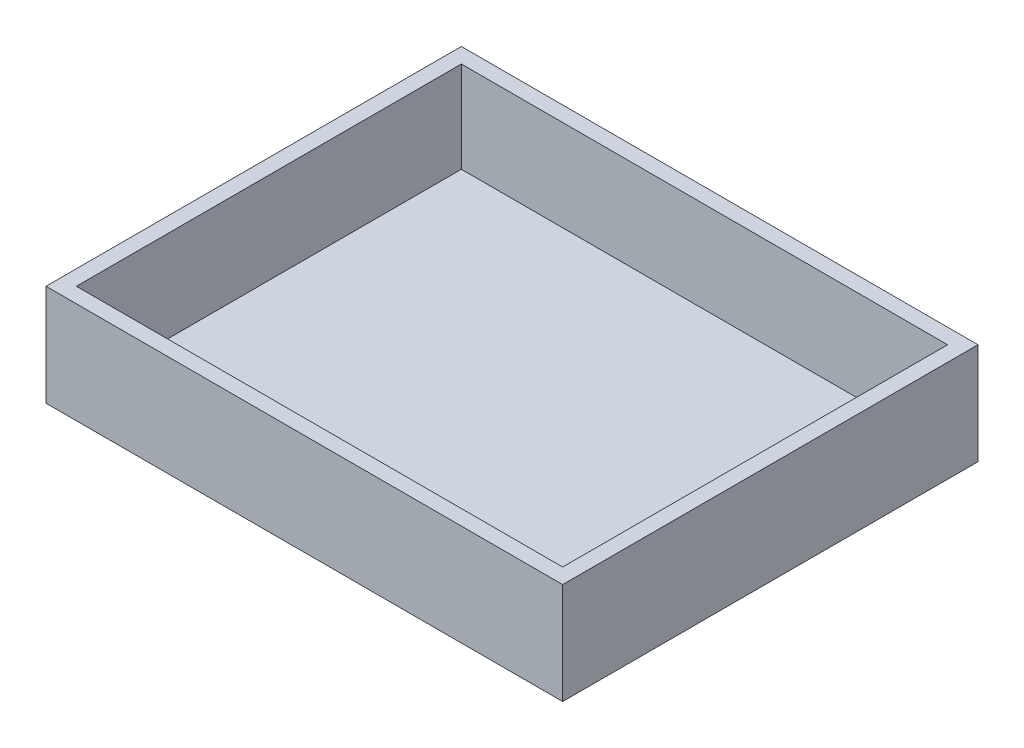
ISO-10303-21;
HEADER;
FILE_DESCRIPTION(('STEP AP214'),'2;1');
FILE_NAME('part.step','',(''),(''),'','','');
FILE_SCHEMA(('AUTOMOTIVE_DESIGN { 1 0 10303 214 1 1 1 1 }'));
ENDSEC;
DATA;
#1=APPLICATION_CONTEXT('core data for automotive mechanical design processes');
#2=APPLICATION_PROTOCOL_DEFINITION('international standard','automotive_design',2000,#1);
#3=PRODUCT_CONTEXT('',#1,'mechanical');
#4=PRODUCT('Part','Part','',(#3));
#5=PRODUCT_RELATED_PRODUCT_CATEGORY('part','',(#4));
#6=PRODUCT_DEFINITION_FORMATION('','',#4);
#7=PRODUCT_DEFINITION_CONTEXT('part definition',#1,'design');
#8=PRODUCT_DEFINITION('design','',#6,#7);
#9=PRODUCT_DEFINITION_SHAPE('','',#8);
#10=(LENGTH_UNIT() NAMED_UNIT(*) SI_UNIT(.MILLI.,.METRE.));
#11=(NAMED_UNIT(*) PLANE_ANGLE_UNIT() SI_UNIT($,.RADIAN.));
#12=(NAMED_UNIT(*) SI_UNIT($,.STERADIAN.) SOLID_ANGLE_UNIT());
#13=UNCERTAINTY_MEASURE_WITH_UNIT(LENGTH_MEASURE(1.E-05),#10,'distance_accuracy_value','');
#14=(GEOMETRIC_REPRESENTATION_CONTEXT(3) GLOBAL_UNCERTAINTY_ASSIGNED_CONTEXT((#13)) GLOBAL_UNIT_ASSIGNED_CONTEXT((#10,
#11,#12)) REPRESENTATION_CONTEXT('',''));
#15=CARTESIAN_POINT('',(0.,0.,0.));
#16=DIRECTION('',(0.,0.,1.));
#17=DIRECTION('',(1.,0.,0.));
#18=AXIS2_PLACEMENT_3D('',#15,#16,#17);
#19=CARTESIAN_POINT('',(0.,1.,-20.5));
#20=DIRECTION('',(0.,0.,-1.));
#21=DIRECTION('',(-1.,0.,0.));
#22=AXIS2_PLACEMENT_3D('',#19,#20,#21);
#23=PLANE('',#22);
#24=DIRECTION('',(1.,0.,0.));
#25=VECTOR('',#24,1.);
#26=CARTESIAN_POINT('',(0.,0.,-20.5));
#27=LINE('',#26,#25);
#28=CARTESIAN_POINT('',(-25.5,0.,-20.5));
#29=VERTEX_POINT('',#28);
#30=CARTESIAN_POINT('',(25.5,0.,-20.5));
#31=VERTEX_POINT('',#30);
#32=EDGE_CURVE('E149',#29,#31,#27,.T.);
#33=ORIENTED_EDGE('',*,*,#32,.F.);
#34=DIRECTION('',(0.,-1.,0.));
#35=VECTOR('',#34,1.);
#36=CARTESIAN_POINT('',(-25.5,1.,-20.5));
#37=LINE('',#36,#35);
#38=CARTESIAN_POINT('',(-25.5,10.,-20.5));
#39=VERTEX_POINT('',#38);
#40=EDGE_CURVE('E11',#39,#29,#37,.T.);
#41=ORIENTED_EDGE('',*,*,#40,.F.);
#42=DIRECTION('',(-1.,0.,0.));
#43=VECTOR('',#42,1.);
#44=CARTESIAN_POINT('',(-25.5,10.,-20.5));
#45=LINE('',#44,#43);
#46=CARTESIAN_POINT('',(25.5,10.,-20.5));
#47=VERTEX_POINT('',#46);
#48=EDGE_CURVE('E139',#47,#39,#45,.T.);
#49=ORIENTED_EDGE('',*,*,#48,.F.);
#50=DIRECTION('',(0.,-1.,0.));
#51=VECTOR('',#50,1.);
#52=CARTESIAN_POINT('',(25.5,1.,-20.5));
#53=LINE('',#52,#51);
#54=EDGE_CURVE('E160',#47,#31,#53,.T.);
#55=ORIENTED_EDGE('',*,*,#54,.T.);
#56=EDGE_LOOP('',(#33,#41,#49,#55));
#57=FACE_BOUND('',#56,.T.);
#58=ADVANCED_FACE('F37',(#57),#23,.T.);
#59=CARTESIAN_POINT('',(-25.5,1.,0.));
#60=DIRECTION('',(1.,0.,0.));
#61=DIRECTION('',(0.,0.,-1.));
#62=AXIS2_PLACEMENT_3D('',#59,#60,#61);
#63=PLANE('',#62);
#64=DIRECTION('',(0.,0.,1.));
#65=VECTOR('',#64,1.);
#66=CARTESIAN_POINT('',(-25.5,0.,0.));
#67=LINE('',#66,#65);
#68=CARTESIAN_POINT('',(-25.5,0.,20.5));
#69=VERTEX_POINT('',#68);
#70=EDGE_CURVE('E152',#29,#69,#67,.T.);
#71=ORIENTED_EDGE('',*,*,#70,.T.);
#72=DIRECTION('',(0.,-1.,0.));
#73=VECTOR('',#72,1.);
#74=CARTESIAN_POINT('',(-25.5,1.,20.5));
#75=LINE('',#74,#73);
#76=CARTESIAN_POINT('',(-25.5,10.,20.5));
#77=VERTEX_POINT('',#76);
#78=EDGE_CURVE('E44',#77,#69,#75,.T.);
#79=ORIENTED_EDGE('',*,*,#78,.F.);
#80=DIRECTION('',(0.,0.,1.));
#81=VECTOR('',#80,1.);
#82=CARTESIAN_POINT('',(-25.5,10.,-20.5));
#83=LINE('',#82,#81);
#84=EDGE_CURVE('E114',#39,#77,#83,.T.);
#85=ORIENTED_EDGE('',*,*,#84,.F.);
#86=ORIENTED_EDGE('',*,*,#40,.T.);
#87=EDGE_LOOP('',(#71,#79,#85,#86));
#88=FACE_BOUND('',#87,.T.);
#89=ADVANCED_FACE('F180',(#88),#63,.F.);
#90=CARTESIAN_POINT('',(0.,1.,20.5));
#91=DIRECTION('',(0.,0.,-1.));
#92=DIRECTION('',(-1.,0.,0.));
#93=AXIS2_PLACEMENT_3D('',#90,#91,#92);
#94=PLANE('',#93);
#95=DIRECTION('',(1.,0.,0.));
#96=VECTOR('',#95,1.);
#97=CARTESIAN_POINT('',(0.,0.,20.5));
#98=LINE('',#97,#96);
#99=CARTESIAN_POINT('',(25.5,0.,20.5));
#100=VERTEX_POINT('',#99);
#101=EDGE_CURVE('E154',#69,#100,#98,.T.);
#102=ORIENTED_EDGE('',*,*,#101,.T.);
#103=DIRECTION('',(0.,-1.,0.));
#104=VECTOR('',#103,1.);
#105=CARTESIAN_POINT('',(25.5,1.,20.5));
#106=LINE('',#105,#104);
#107=CARTESIAN_POINT('',(25.5,10.,20.5));
#108=VERTEX_POINT('',#107);
#109=EDGE_CURVE('E162',#108,#100,#106,.T.);
#110=ORIENTED_EDGE('',*,*,#109,.F.);
#111=DIRECTION('',(1.,0.,0.));
#112=VECTOR('',#111,1.);
#113=CARTESIAN_POINT('',(-25.5,10.,20.5));
#114=LINE('',#113,#112);
#115=EDGE_CURVE('E133',#77,#108,#114,.T.);
#116=ORIENTED_EDGE('',*,*,#115,.F.);
#117=ORIENTED_EDGE('',*,*,#78,.T.);
#118=EDGE_LOOP('',(#102,#110,#116,#117));
#119=FACE_BOUND('',#118,.T.);
#120=ADVANCED_FACE('F167',(#119),#94,.F.);
#121=CARTESIAN_POINT('',(25.5,1.,0.));
#122=DIRECTION('',(1.,0.,0.));
#123=DIRECTION('',(0.,0.,-1.));
#124=AXIS2_PLACEMENT_3D('',#121,#122,#123);
#125=PLANE('',#124);
#126=DIRECTION('',(0.,0.,1.));
#127=VECTOR('',#126,1.);
#128=CARTESIAN_POINT('',(25.5,0.,0.));
#129=LINE('',#128,#127);
#130=EDGE_CURVE('E157',#31,#100,#129,.T.);
#131=ORIENTED_EDGE('',*,*,#130,.F.);
#132=ORIENTED_EDGE('',*,*,#54,.F.);
#133=DIRECTION('',(0.,0.,-1.));
#134=VECTOR('',#133,1.);
#135=CARTESIAN_POINT('',(25.5,10.,-20.5));
#136=LINE('',#135,#134);
#137=EDGE_CURVE('E136',#108,#47,#136,.T.);
#138=ORIENTED_EDGE('',*,*,#137,.F.);
#139=ORIENTED_EDGE('',*,*,#109,.T.);
#140=EDGE_LOOP('',(#131,#132,#138,#139));
#141=FACE_BOUND('',#140,.T.);
#142=ADVANCED_FACE('F176',(#141),#125,.T.);
#143=CARTESIAN_POINT('',(0.,0.,0.));
#144=DIRECTION('',(0.,1.,0.));
#145=DIRECTION('',(0.,0.,1.));
#146=AXIS2_PLACEMENT_3D('',#143,#144,#145);
#147=PLANE('',#146);
#148=ORIENTED_EDGE('',*,*,#32,.T.);
#149=ORIENTED_EDGE('',*,*,#130,.T.);
#150=ORIENTED_EDGE('',*,*,#101,.F.);
#151=ORIENTED_EDGE('',*,*,#70,.F.);
#152=EDGE_LOOP('',(#148,#149,#150,#151));
#153=FACE_BOUND('',#152,.T.);
#154=ADVANCED_FACE('F172',(#153),#147,.F.);
#155=CARTESIAN_POINT('',(0.,10.,0.));
#156=DIRECTION('',(0.,1.,0.));
#157=DIRECTION('',(0.,0.,1.));
#158=AXIS2_PLACEMENT_3D('',#155,#156,#157);
#159=PLANE('',#158);
#160=ORIENTED_EDGE('',*,*,#84,.T.);
#161=ORIENTED_EDGE('',*,*,#115,.T.);
#162=ORIENTED_EDGE('',*,*,#137,.T.);
#163=ORIENTED_EDGE('',*,*,#48,.T.);
#164=EDGE_LOOP('',(#160,#161,#162,#163));
#165=FACE_BOUND('',#164,.T.);
#166=DIRECTION('',(-1.,0.,0.));
#167=VECTOR('',#166,1.);
#168=CARTESIAN_POINT('',(-24.,10.,-19.));
#169=LINE('',#168,#167);
#170=CARTESIAN_POINT('',(24.,10.,-19.));
#171=VERTEX_POINT('',#170);
#172=CARTESIAN_POINT('',(-24.,10.,-19.));
#173=VERTEX_POINT('',#172);
#174=EDGE_CURVE('E108',#171,#173,#169,.T.);
#175=ORIENTED_EDGE('',*,*,#174,.F.);
#176=DIRECTION('',(0.,0.,-1.));
#177=VECTOR('',#176,1.);
#178=CARTESIAN_POINT('',(24.,10.,-19.));
#179=LINE('',#178,#177);
#180=CARTESIAN_POINT('',(24.,10.,19.));
#181=VERTEX_POINT('',#180);
#182=EDGE_CURVE('E99',#181,#171,#179,.T.);
#183=ORIENTED_EDGE('',*,*,#182,.F.);
#184=DIRECTION('',(1.,0.,0.));
#185=VECTOR('',#184,1.);
#186=CARTESIAN_POINT('',(-24.,10.,19.));
#187=LINE('',#186,#185);
#188=CARTESIAN_POINT('',(-24.,10.,19.));
#189=VERTEX_POINT('',#188);
#190=EDGE_CURVE('E122',#189,#181,#187,.T.);
#191=ORIENTED_EDGE('',*,*,#190,.F.);
#192=DIRECTION('',(0.,0.,1.));
#193=VECTOR('',#192,1.);
#194=CARTESIAN_POINT('',(-24.,10.,-19.));
#195=LINE('',#194,#193);
#196=EDGE_CURVE('E120',#173,#189,#195,.T.);
#197=ORIENTED_EDGE('',*,*,#196,.F.);
#198=EDGE_LOOP('',(#175,#183,#191,#197));
#199=FACE_BOUND('',#198,.T.);
#200=ADVANCED_FACE('F118',(#165,#199),#159,.T.);
#201=CARTESIAN_POINT('',(24.,10.,-19.));
#202=DIRECTION('',(-1.,0.,0.));
#203=DIRECTION('',(0.,0.,1.));
#204=AXIS2_PLACEMENT_3D('',#201,#202,#203);
#205=PLANE('',#204);
#206=DIRECTION('',(0.,-1.,0.));
#207=VECTOR('',#206,1.);
#208=CARTESIAN_POINT('',(24.,10.,-19.));
#209=LINE('',#208,#207);
#210=CARTESIAN_POINT('',(24.,1.,-19.));
#211=VERTEX_POINT('',#210);
#212=EDGE_CURVE('E102',#171,#211,#209,.T.);
#213=ORIENTED_EDGE('',*,*,#212,.T.);
#214=DIRECTION('',(0.,0.,1.));
#215=VECTOR('',#214,1.);
#216=CARTESIAN_POINT('',(24.,1.,0.));
#217=LINE('',#216,#215);
#218=CARTESIAN_POINT('',(24.,1.,19.));
#219=VERTEX_POINT('',#218);
#220=EDGE_CURVE('E51',#211,#219,#217,.T.);
#221=ORIENTED_EDGE('',*,*,#220,.T.);
#222=DIRECTION('',(0.,-1.,0.));
#223=VECTOR('',#222,1.);
#224=CARTESIAN_POINT('',(24.,10.,19.));
#225=LINE('',#224,#223);
#226=EDGE_CURVE('E104',#181,#219,#225,.T.);
#227=ORIENTED_EDGE('',*,*,#226,.F.);
#228=ORIENTED_EDGE('',*,*,#182,.T.);
#229=EDGE_LOOP('',(#213,#221,#227,#228));
#230=FACE_BOUND('',#229,.T.);
#231=ADVANCED_FACE('F101',(#230),#205,.T.);
#232=CARTESIAN_POINT('',(-24.,10.,-19.));
#233=DIRECTION('',(0.,0.,1.));
#234=DIRECTION('',(1.,0.,0.));
#235=AXIS2_PLACEMENT_3D('',#232,#233,#234);
#236=PLANE('',#235);
#237=DIRECTION('',(0.,-1.,0.));
#238=VECTOR('',#237,1.);
#239=CARTESIAN_POINT('',(-24.,10.,-19.));
#240=LINE('',#239,#238);
#241=CARTESIAN_POINT('',(-24.,1.,-19.));
#242=VERTEX_POINT('',#241);
#243=EDGE_CURVE('E115',#173,#242,#240,.T.);
#244=ORIENTED_EDGE('',*,*,#243,.T.);
#245=DIRECTION('',(1.,0.,0.));
#246=VECTOR('',#245,1.);
#247=CARTESIAN_POINT('',(0.,1.,-19.));
#248=LINE('',#247,#246);
#249=EDGE_CURVE('E55',#242,#211,#248,.T.);
#250=ORIENTED_EDGE('',*,*,#249,.T.);
#251=ORIENTED_EDGE('',*,*,#212,.F.);
#252=ORIENTED_EDGE('',*,*,#174,.T.);
#253=EDGE_LOOP('',(#244,#250,#251,#252));
#254=FACE_BOUND('',#253,.T.);
#255=ADVANCED_FACE('F112',(#254),#236,.T.);
#256=CARTESIAN_POINT('',(-24.,10.,-19.));
#257=DIRECTION('',(1.,0.,0.));
#258=DIRECTION('',(0.,0.,-1.));
#259=AXIS2_PLACEMENT_3D('',#256,#257,#258);
#260=PLANE('',#259);
#261=DIRECTION('',(0.,-1.,0.));
#262=VECTOR('',#261,1.);
#263=CARTESIAN_POINT('',(-24.,10.,19.));
#264=LINE('',#263,#262);
#265=CARTESIAN_POINT('',(-24.,0.999999999999999,19.));
#266=VERTEX_POINT('',#265);
#267=EDGE_CURVE('E127',#189,#266,#264,.T.);
#268=ORIENTED_EDGE('',*,*,#267,.T.);
#269=DIRECTION('',(0.,0.,-1.));
#270=VECTOR('',#269,1.);
#271=CARTESIAN_POINT('',(-24.,1.,0.));
#272=LINE('',#271,#270);
#273=EDGE_CURVE('E145',#266,#242,#272,.T.);
#274=ORIENTED_EDGE('',*,*,#273,.T.);
#275=ORIENTED_EDGE('',*,*,#243,.F.);
#276=ORIENTED_EDGE('',*,*,#196,.T.);
#277=EDGE_LOOP('',(#268,#274,#275,#276));
#278=FACE_BOUND('',#277,.T.);
#279=ADVANCED_FACE('F205',(#278),#260,.T.);
#280=CARTESIAN_POINT('',(-24.,10.,19.));
#281=DIRECTION('',(0.,0.,-1.));
#282=DIRECTION('',(-1.,0.,0.));
#283=AXIS2_PLACEMENT_3D('',#280,#281,#282);
#284=PLANE('',#283);
#285=ORIENTED_EDGE('',*,*,#226,.T.);
#286=DIRECTION('',(-1.,0.,0.));
#287=VECTOR('',#286,1.);
#288=CARTESIAN_POINT('',(0.,1.,19.));
#289=LINE('',#288,#287);
#290=EDGE_CURVE('E142',#219,#266,#289,.T.);
#291=ORIENTED_EDGE('',*,*,#290,.T.);
#292=ORIENTED_EDGE('',*,*,#267,.F.);
#293=ORIENTED_EDGE('',*,*,#190,.T.);
#294=EDGE_LOOP('',(#285,#291,#292,#293));
#295=FACE_BOUND('',#294,.T.);
#296=ADVANCED_FACE('F198',(#295),#284,.T.);
#297=CARTESIAN_POINT('',(0.,1.,0.));
#298=DIRECTION('',(0.,1.,0.));
#299=DIRECTION('',(0.,0.,1.));
#300=AXIS2_PLACEMENT_3D('',#297,#298,#299);
#301=PLANE('',#300);
#302=ORIENTED_EDGE('',*,*,#220,.F.);
#303=ORIENTED_EDGE('',*,*,#249,.F.);
#304=ORIENTED_EDGE('',*,*,#273,.F.);
#305=ORIENTED_EDGE('',*,*,#290,.F.);
#306=EDGE_LOOP('',(#302,#303,#304,#305));
#307=FACE_BOUND('',#306,.T.);
#308=ADVANCED_FACE('F195',(#307),#301,.T.);
#309=CLOSED_SHELL('',(#58,#89,#120,#142,#154,#200,#231,#255,#279,#296,#308));
#310=MANIFOLD_SOLID_BREP('B2',#309);
#311=ADVANCED_BREP_SHAPE_REPRESENTATION('',(#18,#310),#14);
#312=SHAPE_DEFINITION_REPRESENTATION(#9,#311);
ENDSEC;
END-ISO-10303-21;
